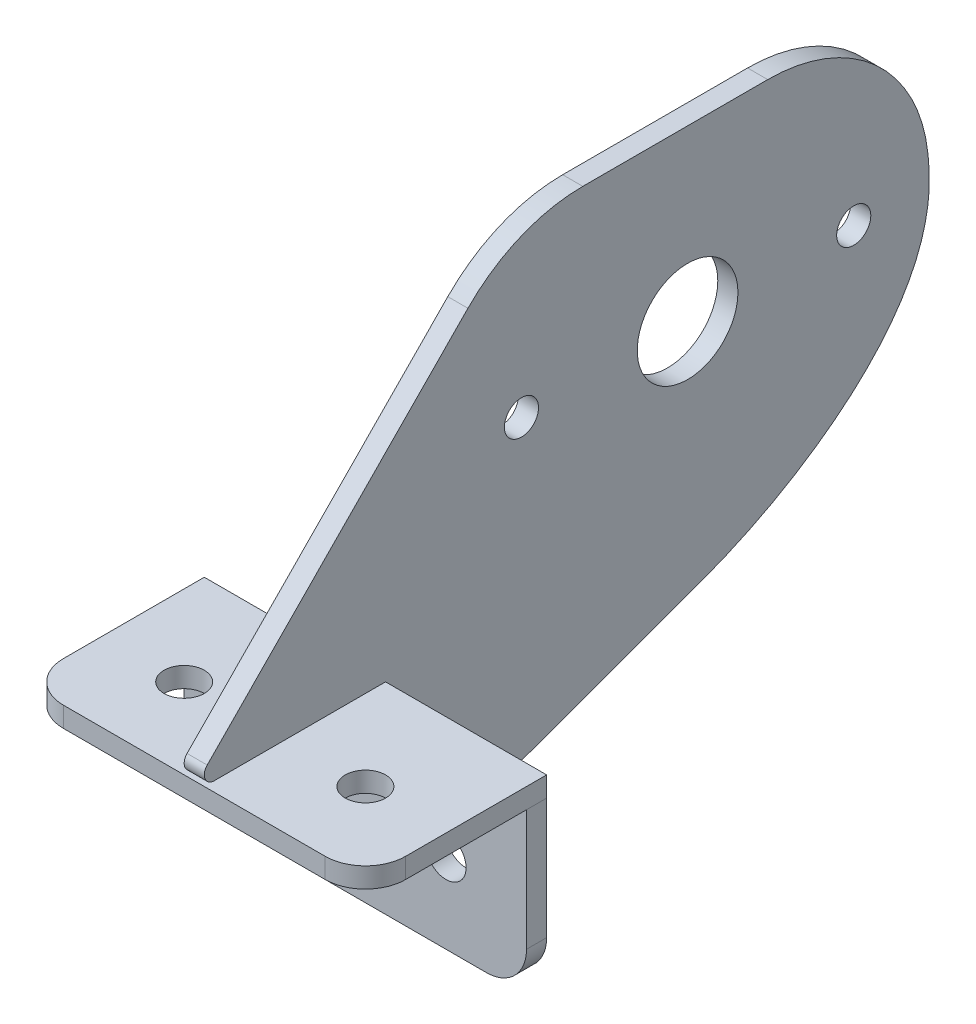
ISO-10303-21;
HEADER;
FILE_DESCRIPTION(('STEP AP214'),'2;1');
FILE_NAME('part.step','',(''),(''),'','','');
FILE_SCHEMA(('AUTOMOTIVE_DESIGN { 1 0 10303 214 1 1 1 1 }'));
ENDSEC;
DATA;
#1=APPLICATION_CONTEXT('core data for automotive mechanical design processes');
#2=APPLICATION_PROTOCOL_DEFINITION('international standard','automotive_design',2000,#1);
#3=PRODUCT_CONTEXT('',#1,'mechanical');
#4=PRODUCT('Part','Part','',(#3));
#5=PRODUCT_RELATED_PRODUCT_CATEGORY('part','',(#4));
#6=PRODUCT_DEFINITION_FORMATION('','',#4);
#7=PRODUCT_DEFINITION_CONTEXT('part definition',#1,'design');
#8=PRODUCT_DEFINITION('design','',#6,#7);
#9=PRODUCT_DEFINITION_SHAPE('','',#8);
#10=(LENGTH_UNIT() NAMED_UNIT(*) SI_UNIT(.MILLI.,.METRE.));
#11=(NAMED_UNIT(*) PLANE_ANGLE_UNIT() SI_UNIT($,.RADIAN.));
#12=(NAMED_UNIT(*) SI_UNIT($,.STERADIAN.) SOLID_ANGLE_UNIT());
#13=UNCERTAINTY_MEASURE_WITH_UNIT(LENGTH_MEASURE(1.E-05),#10,'distance_accuracy_value','');
#14=(GEOMETRIC_REPRESENTATION_CONTEXT(3) GLOBAL_UNCERTAINTY_ASSIGNED_CONTEXT((#13)) GLOBAL_UNIT_ASSIGNED_CONTEXT((#10,
#11,#12)) REPRESENTATION_CONTEXT('',''));
#15=CARTESIAN_POINT('',(0.,0.,0.));
#16=DIRECTION('',(0.,0.,1.));
#17=DIRECTION('',(1.,0.,0.));
#18=AXIS2_PLACEMENT_3D('',#15,#16,#17);
#19=CARTESIAN_POINT('',(-19.05,-47.6251280434519,50.7988006165077));
#20=DIRECTION('',(0.,0.,1.));
#21=DIRECTION('',(1.,0.,0.));
#22=AXIS2_PLACEMENT_3D('',#19,#20,#21);
#23=PLANE('',#22);
#24=CARTESIAN_POINT('',(-12.7,-41.2751280434519,50.7988006165077));
#25=DIRECTION('',(0.,0.,1.));
#26=DIRECTION('',(1.,0.,0.));
#27=AXIS2_PLACEMENT_3D('',#24,#25,#26);
#28=CIRCLE('',#27,3.175);
#29=CARTESIAN_POINT('',(-9.525,-41.2751280434519,50.7988006165077));
#30=VERTEX_POINT('',#29);
#31=EDGE_CURVE('E149',#30,#30,#28,.T.);
#32=ORIENTED_EDGE('',*,*,#31,.F.);
#33=EDGE_LOOP('',(#32));
#34=FACE_BOUND('',#33,.T.);
#35=DIRECTION('',(0.,-1.,0.));
#36=VECTOR('',#35,1.);
#37=CARTESIAN_POINT('',(-25.4,-28.5751280434519,50.7988006165077));
#38=LINE('',#37,#36);
#39=CARTESIAN_POINT('',(-25.4,-28.5751280434519,50.7988006165077));
#40=VERTEX_POINT('',#39);
#41=CARTESIAN_POINT('',(-25.4,-47.6251280434519,50.7988006165077));
#42=VERTEX_POINT('',#41);
#43=EDGE_CURVE('E161',#40,#42,#38,.T.);
#44=ORIENTED_EDGE('',*,*,#43,.T.);
#45=CARTESIAN_POINT('',(-19.05,-47.6251280434519,50.7988006165077));
#46=DIRECTION('',(0.,0.,1.));
#47=DIRECTION('',(1.,0.,0.));
#48=AXIS2_PLACEMENT_3D('',#45,#46,#47);
#49=CIRCLE('',#48,6.35);
#50=CARTESIAN_POINT('',(-19.05,-53.9751280434519,50.7988006165077));
#51=VERTEX_POINT('',#50);
#52=EDGE_CURVE('E112',#42,#51,#49,.T.);
#53=ORIENTED_EDGE('',*,*,#52,.T.);
#54=DIRECTION('',(1.,0.,0.));
#55=VECTOR('',#54,1.);
#56=CARTESIAN_POINT('',(-19.05,-53.9751280434519,50.7988006165077));
#57=LINE('',#56,#55);
#58=CARTESIAN_POINT('',(22.225,-53.9751280434519,50.7988006165077));
#59=VERTEX_POINT('',#58);
#60=EDGE_CURVE('E125',#51,#59,#57,.T.);
#61=ORIENTED_EDGE('',*,*,#60,.T.);
#62=CARTESIAN_POINT('',(22.225,-47.6251280434519,50.7988006165077));
#63=DIRECTION('',(0.,0.,1.));
#64=DIRECTION('',(1.,0.,0.));
#65=AXIS2_PLACEMENT_3D('',#62,#63,#64);
#66=CIRCLE('',#65,6.35);
#67=CARTESIAN_POINT('',(28.575,-47.6251280434519,50.7988006165077));
#68=VERTEX_POINT('',#67);
#69=EDGE_CURVE('E119',#59,#68,#66,.T.);
#70=ORIENTED_EDGE('',*,*,#69,.T.);
#71=DIRECTION('',(0.,1.,0.));
#72=VECTOR('',#71,1.);
#73=CARTESIAN_POINT('',(28.575,-28.5751280434519,50.7988006165077));
#74=LINE('',#73,#72);
#75=CARTESIAN_POINT('',(28.575,-28.5751280434519,50.7988006165077));
#76=VERTEX_POINT('',#75);
#77=EDGE_CURVE('E123',#68,#76,#74,.T.);
#78=ORIENTED_EDGE('',*,*,#77,.T.);
#79=DIRECTION('',(-1.,0.,0.));
#80=VECTOR('',#79,1.);
#81=CARTESIAN_POINT('',(-25.4,-28.5751280434519,50.7988006165077));
#82=LINE('',#81,#80);
#83=EDGE_CURVE('E75',#76,#40,#82,.T.);
#84=ORIENTED_EDGE('',*,*,#83,.T.);
#85=EDGE_LOOP('',(#44,#53,#61,#70,#78,#84));
#86=FACE_BOUND('',#85,.T.);
#87=CARTESIAN_POINT('',(15.875,-41.2751280434519,50.7988006165077));
#88=DIRECTION('',(0.,0.,1.));
#89=DIRECTION('',(1.,0.,0.));
#90=AXIS2_PLACEMENT_3D('',#87,#88,#89);
#91=CIRCLE('',#90,3.175);
#92=CARTESIAN_POINT('',(19.05,-41.2751280434519,50.7988006165077));
#93=VERTEX_POINT('',#92);
#94=EDGE_CURVE('E189',#93,#93,#91,.T.);
#95=ORIENTED_EDGE('',*,*,#94,.F.);
#96=EDGE_LOOP('',(#95));
#97=FACE_BOUND('',#96,.T.);
#98=ADVANCED_FACE('F58',(#34,#86,#97),#23,.T.);
#99=CARTESIAN_POINT('',(-19.05,-47.6251280434519,47.6238006165077));
#100=DIRECTION('',(0.,0.,1.));
#101=DIRECTION('',(1.,0.,0.));
#102=AXIS2_PLACEMENT_3D('',#99,#100,#101);
#103=PLANE('',#102);
#104=DIRECTION('',(0.,-1.,0.));
#105=VECTOR('',#104,1.);
#106=CARTESIAN_POINT('',(-25.4,-28.5751280434519,47.6238006165077));
#107=LINE('',#106,#105);
#108=CARTESIAN_POINT('',(-25.4,-28.5751280434519,47.6238006165077));
#109=VERTEX_POINT('',#108);
#110=CARTESIAN_POINT('',(-25.4,-47.6251280434519,47.6238006165077));
#111=VERTEX_POINT('',#110);
#112=EDGE_CURVE('E143',#109,#111,#107,.T.);
#113=ORIENTED_EDGE('',*,*,#112,.F.);
#114=DIRECTION('',(-1.,0.,0.));
#115=VECTOR('',#114,1.);
#116=CARTESIAN_POINT('',(-25.4,-28.5751280434519,47.6238006165077));
#117=LINE('',#116,#115);
#118=CARTESIAN_POINT('',(28.575,-28.5751280434519,47.6238006165077));
#119=VERTEX_POINT('',#118);
#120=EDGE_CURVE('E104',#119,#109,#117,.T.);
#121=ORIENTED_EDGE('',*,*,#120,.F.);
#122=DIRECTION('',(0.,1.,0.));
#123=VECTOR('',#122,1.);
#124=CARTESIAN_POINT('',(28.575,-28.5751280434519,47.6238006165077));
#125=LINE('',#124,#123);
#126=CARTESIAN_POINT('',(28.575,-47.6251280434519,47.6238006165077));
#127=VERTEX_POINT('',#126);
#128=EDGE_CURVE('E98',#127,#119,#125,.T.);
#129=ORIENTED_EDGE('',*,*,#128,.F.);
#130=CARTESIAN_POINT('',(22.225,-47.6251280434519,47.6238006165077));
#131=DIRECTION('',(0.,0.,1.));
#132=DIRECTION('',(1.,0.,0.));
#133=AXIS2_PLACEMENT_3D('',#130,#131,#132);
#134=CIRCLE('',#133,6.35);
#135=CARTESIAN_POINT('',(22.225,-53.9751280434519,47.6238006165077));
#136=VERTEX_POINT('',#135);
#137=EDGE_CURVE('E133',#136,#127,#134,.T.);
#138=ORIENTED_EDGE('',*,*,#137,.F.);
#139=DIRECTION('',(1.,0.,0.));
#140=VECTOR('',#139,1.);
#141=CARTESIAN_POINT('',(-19.05,-53.9751280434519,47.6238006165077));
#142=LINE('',#141,#140);
#143=CARTESIAN_POINT('',(-19.05,-53.9751280434519,47.6238006165077));
#144=VERTEX_POINT('',#143);
#145=EDGE_CURVE('E170',#144,#136,#142,.T.);
#146=ORIENTED_EDGE('',*,*,#145,.F.);
#147=CARTESIAN_POINT('',(-19.05,-47.6251280434519,47.6238006165077));
#148=DIRECTION('',(0.,0.,1.));
#149=DIRECTION('',(1.,0.,0.));
#150=AXIS2_PLACEMENT_3D('',#147,#148,#149);
#151=CIRCLE('',#150,6.35);
#152=EDGE_CURVE('E148',#111,#144,#151,.T.);
#153=ORIENTED_EDGE('',*,*,#152,.F.);
#154=EDGE_LOOP('',(#113,#121,#129,#138,#146,#153));
#155=FACE_BOUND('',#154,.T.);
#156=CARTESIAN_POINT('',(-12.7,-41.2751280434519,47.6238006165077));
#157=DIRECTION('',(0.,0.,1.));
#158=DIRECTION('',(1.,0.,0.));
#159=AXIS2_PLACEMENT_3D('',#156,#157,#158);
#160=CIRCLE('',#159,3.175);
#161=CARTESIAN_POINT('',(-9.525,-41.2751280434519,47.6238006165077));
#162=VERTEX_POINT('',#161);
#163=EDGE_CURVE('E183',#162,#162,#160,.T.);
#164=ORIENTED_EDGE('',*,*,#163,.T.);
#165=EDGE_LOOP('',(#164));
#166=FACE_BOUND('',#165,.T.);
#167=CARTESIAN_POINT('',(15.875,-41.2751280434519,47.6238006165077));
#168=DIRECTION('',(0.,0.,1.));
#169=DIRECTION('',(1.,0.,0.));
#170=AXIS2_PLACEMENT_3D('',#167,#168,#169);
#171=CIRCLE('',#170,3.175);
#172=CARTESIAN_POINT('',(19.05,-41.2751280434519,47.6238006165077));
#173=VERTEX_POINT('',#172);
#174=EDGE_CURVE('E285',#173,#173,#171,.T.);
#175=ORIENTED_EDGE('',*,*,#174,.T.);
#176=EDGE_LOOP('',(#175));
#177=FACE_BOUND('',#176,.T.);
#178=ADVANCED_FACE('F173',(#155,#166,#177),#103,.F.);
#179=CARTESIAN_POINT('',(-25.4,-28.5751280434519,50.7988006165077));
#180=DIRECTION('',(1.,0.,0.));
#181=DIRECTION('',(0.,1.,0.));
#182=AXIS2_PLACEMENT_3D('',#179,#180,#181);
#183=PLANE('',#182);
#184=ORIENTED_EDGE('',*,*,#112,.T.);
#185=DIRECTION('',(0.,0.,-1.));
#186=VECTOR('',#185,1.);
#187=CARTESIAN_POINT('',(-25.4,-47.6251280434519,50.7988006165077));
#188=LINE('',#187,#186);
#189=EDGE_CURVE('E13',#42,#111,#188,.T.);
#190=ORIENTED_EDGE('',*,*,#189,.F.);
#191=ORIENTED_EDGE('',*,*,#43,.F.);
#192=DIRECTION('',(0.,0.,-1.));
#193=VECTOR('',#192,1.);
#194=CARTESIAN_POINT('',(-25.4,-28.5751280434519,50.7988006165077));
#195=LINE('',#194,#193);
#196=EDGE_CURVE('E139',#40,#109,#195,.T.);
#197=ORIENTED_EDGE('',*,*,#196,.T.);
#198=EDGE_LOOP('',(#184,#190,#191,#197));
#199=FACE_BOUND('',#198,.T.);
#200=ADVANCED_FACE('F60',(#199),#183,.F.);
#201=CARTESIAN_POINT('',(-19.05,-47.6251280434519,50.7988006165077));
#202=DIRECTION('',(0.,0.,-1.));
#203=DIRECTION('',(-1.,0.,0.));
#204=AXIS2_PLACEMENT_3D('',#201,#202,#203);
#205=CYLINDRICAL_SURFACE('',#204,6.35);
#206=ORIENTED_EDGE('',*,*,#152,.T.);
#207=DIRECTION('',(0.,0.,-1.));
#208=VECTOR('',#207,1.);
#209=CARTESIAN_POINT('',(-19.05,-53.9751280434519,50.7988006165077));
#210=LINE('',#209,#208);
#211=EDGE_CURVE('E67',#51,#144,#210,.T.);
#212=ORIENTED_EDGE('',*,*,#211,.F.);
#213=ORIENTED_EDGE('',*,*,#52,.F.);
#214=ORIENTED_EDGE('',*,*,#189,.T.);
#215=EDGE_LOOP('',(#206,#212,#213,#214));
#216=FACE_BOUND('',#215,.T.);
#217=ADVANCED_FACE('F194',(#216),#205,.T.);
#218=CARTESIAN_POINT('',(-19.05,-53.9751280434519,50.7988006165077));
#219=DIRECTION('',(0.,1.,0.));
#220=DIRECTION('',(0.,0.,1.));
#221=AXIS2_PLACEMENT_3D('',#218,#219,#220);
#222=PLANE('',#221);
#223=ORIENTED_EDGE('',*,*,#145,.T.);
#224=DIRECTION('',(0.,0.,-1.));
#225=VECTOR('',#224,1.);
#226=CARTESIAN_POINT('',(22.225,-53.9751280434519,50.7988006165077));
#227=LINE('',#226,#225);
#228=EDGE_CURVE('E134',#59,#136,#227,.T.);
#229=ORIENTED_EDGE('',*,*,#228,.F.);
#230=ORIENTED_EDGE('',*,*,#60,.F.);
#231=ORIENTED_EDGE('',*,*,#211,.T.);
#232=EDGE_LOOP('',(#223,#229,#230,#231));
#233=FACE_BOUND('',#232,.T.);
#234=ADVANCED_FACE('F169',(#233),#222,.F.);
#235=CARTESIAN_POINT('',(22.225,-47.6251280434519,50.7988006165077));
#236=DIRECTION('',(0.,0.,-1.));
#237=DIRECTION('',(-1.,0.,0.));
#238=AXIS2_PLACEMENT_3D('',#235,#236,#237);
#239=CYLINDRICAL_SURFACE('',#238,6.35);
#240=ORIENTED_EDGE('',*,*,#137,.T.);
#241=DIRECTION('',(0.,0.,-1.));
#242=VECTOR('',#241,1.);
#243=CARTESIAN_POINT('',(28.575,-47.6251280434519,50.7988006165077));
#244=LINE('',#243,#242);
#245=EDGE_CURVE('E130',#68,#127,#244,.T.);
#246=ORIENTED_EDGE('',*,*,#245,.F.);
#247=ORIENTED_EDGE('',*,*,#69,.F.);
#248=ORIENTED_EDGE('',*,*,#228,.T.);
#249=EDGE_LOOP('',(#240,#246,#247,#248));
#250=FACE_BOUND('',#249,.T.);
#251=ADVANCED_FACE('F131',(#250),#239,.T.);
#252=CARTESIAN_POINT('',(28.575,-28.5751280434519,50.7988006165077));
#253=DIRECTION('',(-1.,0.,0.));
#254=DIRECTION('',(0.,0.,1.));
#255=AXIS2_PLACEMENT_3D('',#252,#253,#254);
#256=PLANE('',#255);
#257=ORIENTED_EDGE('',*,*,#128,.T.);
#258=DIRECTION('',(0.,0.,-1.));
#259=VECTOR('',#258,1.);
#260=CARTESIAN_POINT('',(28.575,-28.5751280434519,50.7988006165077));
#261=LINE('',#260,#259);
#262=EDGE_CURVE('E135',#76,#119,#261,.T.);
#263=ORIENTED_EDGE('',*,*,#262,.F.);
#264=ORIENTED_EDGE('',*,*,#77,.F.);
#265=ORIENTED_EDGE('',*,*,#245,.T.);
#266=EDGE_LOOP('',(#257,#263,#264,#265));
#267=FACE_BOUND('',#266,.T.);
#268=ADVANCED_FACE('F137',(#267),#256,.F.);
#269=CARTESIAN_POINT('',(-25.4,-28.5751280434519,50.7988006165077));
#270=DIRECTION('',(0.,-1.,0.));
#271=DIRECTION('',(0.,0.,-1.));
#272=AXIS2_PLACEMENT_3D('',#269,#270,#271);
#273=PLANE('',#272);
#274=ORIENTED_EDGE('',*,*,#120,.T.);
#275=ORIENTED_EDGE('',*,*,#196,.F.);
#276=ORIENTED_EDGE('',*,*,#83,.F.);
#277=ORIENTED_EDGE('',*,*,#262,.T.);
#278=EDGE_LOOP('',(#274,#275,#276,#277));
#279=FACE_BOUND('',#278,.T.);
#280=ADVANCED_FACE('F213',(#279),#273,.F.);
#281=CARTESIAN_POINT('',(-12.7,-41.2751280434519,50.7988006165077));
#282=DIRECTION('',(0.,0.,-1.));
#283=DIRECTION('',(-1.,0.,0.));
#284=AXIS2_PLACEMENT_3D('',#281,#282,#283);
#285=CYLINDRICAL_SURFACE('',#284,3.175);
#286=ORIENTED_EDGE('',*,*,#31,.T.);
#287=EDGE_LOOP('',(#286));
#288=FACE_BOUND('',#287,.T.);
#289=ORIENTED_EDGE('',*,*,#163,.F.);
#290=EDGE_LOOP('',(#289));
#291=FACE_BOUND('',#290,.T.);
#292=ADVANCED_FACE('F210',(#288,#291),#285,.F.);
#293=CARTESIAN_POINT('',(15.875,-41.2751280434519,50.7988006165077));
#294=DIRECTION('',(0.,0.,-1.));
#295=DIRECTION('',(-1.,0.,0.));
#296=AXIS2_PLACEMENT_3D('',#293,#294,#295);
#297=CYLINDRICAL_SURFACE('',#296,3.175);
#298=ORIENTED_EDGE('',*,*,#94,.T.);
#299=EDGE_LOOP('',(#298));
#300=FACE_BOUND('',#299,.T.);
#301=ORIENTED_EDGE('',*,*,#174,.F.);
#302=EDGE_LOOP('',(#301));
#303=FACE_BOUND('',#302,.T.);
#304=ADVANCED_FACE('F237',(#300,#303),#297,.F.);
#305=CLOSED_SHELL('',(#98,#178,#200,#217,#234,#251,#268,#280,#292,#304));
#306=MANIFOLD_SOLID_BREP('B2',#305);
#307=CARTESIAN_POINT('',(-19.05,-28.5751280434519,69.8488006165077));
#308=DIRECTION('',(0.,-1.,0.));
#309=DIRECTION('',(0.,0.,-1.));
#310=AXIS2_PLACEMENT_3D('',#307,#308,#309);
#311=PLANE('',#310);
#312=CARTESIAN_POINT('',(15.875,-28.5751280434519,63.4988006165077));
#313=DIRECTION('',(0.,-1.,0.));
#314=DIRECTION('',(0.,0.,-1.));
#315=AXIS2_PLACEMENT_3D('',#312,#313,#314);
#316=CIRCLE('',#315,3.17499999999999);
#317=CARTESIAN_POINT('',(15.875,-28.5751280434519,60.3238006165077));
#318=VERTEX_POINT('',#317);
#319=EDGE_CURVE('E400',#318,#318,#316,.T.);
#320=ORIENTED_EDGE('',*,*,#319,.F.);
#321=EDGE_LOOP('',(#320));
#322=FACE_BOUND('',#321,.T.);
#323=DIRECTION('',(1.,0.,0.));
#324=VECTOR('',#323,1.);
#325=CARTESIAN_POINT('',(28.575,-28.5751280434519,47.6238006165077));
#326=LINE('',#325,#324);
#327=CARTESIAN_POINT('',(-25.4,-28.5751280434519,47.6238006165077));
#328=VERTEX_POINT('',#327);
#329=CARTESIAN_POINT('',(28.575,-28.5751280434519,47.6238006165077));
#330=VERTEX_POINT('',#329);
#331=EDGE_CURVE('E412',#328,#330,#326,.T.);
#332=ORIENTED_EDGE('',*,*,#331,.T.);
#333=DIRECTION('',(0.,0.,1.));
#334=VECTOR('',#333,1.);
#335=CARTESIAN_POINT('',(28.575,-28.5751280434519,69.8488006165077));
#336=LINE('',#335,#334);
#337=CARTESIAN_POINT('',(28.575,-28.5751280434519,69.8488006165077));
#338=VERTEX_POINT('',#337);
#339=EDGE_CURVE('E363',#330,#338,#336,.T.);
#340=ORIENTED_EDGE('',*,*,#339,.T.);
#341=CARTESIAN_POINT('',(22.225,-28.5751280434519,69.8488006165077));
#342=DIRECTION('',(0.,-1.,0.));
#343=DIRECTION('',(0.,0.,-1.));
#344=AXIS2_PLACEMENT_3D('',#341,#342,#343);
#345=CIRCLE('',#344,6.35);
#346=CARTESIAN_POINT('',(22.225,-28.5751280434519,76.1988006165077));
#347=VERTEX_POINT('',#346);
#348=EDGE_CURVE('E376',#338,#347,#345,.T.);
#349=ORIENTED_EDGE('',*,*,#348,.T.);
#350=DIRECTION('',(-1.,0.,0.));
#351=VECTOR('',#350,1.);
#352=CARTESIAN_POINT('',(22.225,-28.5751280434519,76.1988006165077));
#353=LINE('',#352,#351);
#354=CARTESIAN_POINT('',(-19.05,-28.5751280434519,76.1988006165077));
#355=VERTEX_POINT('',#354);
#356=EDGE_CURVE('E370',#347,#355,#353,.T.);
#357=ORIENTED_EDGE('',*,*,#356,.T.);
#358=CARTESIAN_POINT('',(-19.05,-28.5751280434519,69.8488006165077));
#359=DIRECTION('',(0.,-1.,0.));
#360=DIRECTION('',(0.,0.,-1.));
#361=AXIS2_PLACEMENT_3D('',#358,#359,#360);
#362=CIRCLE('',#361,6.35);
#363=CARTESIAN_POINT('',(-25.4,-28.5751280434519,69.8488006165077));
#364=VERTEX_POINT('',#363);
#365=EDGE_CURVE('E374',#355,#364,#362,.T.);
#366=ORIENTED_EDGE('',*,*,#365,.T.);
#367=DIRECTION('',(0.,0.,-1.));
#368=VECTOR('',#367,1.);
#369=CARTESIAN_POINT('',(-25.4,-28.5751280434519,69.8488006165077));
#370=LINE('',#369,#368);
#371=EDGE_CURVE('E326',#364,#328,#370,.T.);
#372=ORIENTED_EDGE('',*,*,#371,.T.);
#373=EDGE_LOOP('',(#332,#340,#349,#357,#366,#372));
#374=FACE_BOUND('',#373,.T.);
#375=CARTESIAN_POINT('',(-12.7,-28.5751280434519,63.4988006165077));
#376=DIRECTION('',(0.,-1.,0.));
#377=DIRECTION('',(0.,0.,-1.));
#378=AXIS2_PLACEMENT_3D('',#375,#376,#377);
#379=CIRCLE('',#378,3.17499999999999);
#380=CARTESIAN_POINT('',(-12.7,-28.5751280434519,60.3238006165077));
#381=VERTEX_POINT('',#380);
#382=EDGE_CURVE('E440',#381,#381,#379,.T.);
#383=ORIENTED_EDGE('',*,*,#382,.F.);
#384=EDGE_LOOP('',(#383));
#385=FACE_BOUND('',#384,.T.);
#386=ADVANCED_FACE('F309',(#322,#374,#385),#311,.T.);
#387=CARTESIAN_POINT('',(-19.05,-25.4001280434519,69.8488006165077));
#388=DIRECTION('',(0.,-1.,0.));
#389=DIRECTION('',(0.,0.,-1.));
#390=AXIS2_PLACEMENT_3D('',#387,#388,#389);
#391=PLANE('',#390);
#392=DIRECTION('',(1.,0.,0.));
#393=VECTOR('',#392,1.);
#394=CARTESIAN_POINT('',(28.575,-25.4001280434519,47.6238006165077));
#395=LINE('',#394,#393);
#396=CARTESIAN_POINT('',(-25.4,-25.4001280434519,47.6238006165077));
#397=VERTEX_POINT('',#396);
#398=CARTESIAN_POINT('',(28.575,-25.4001280434519,47.6238006165077));
#399=VERTEX_POINT('',#398);
#400=EDGE_CURVE('E394',#397,#399,#395,.T.);
#401=ORIENTED_EDGE('',*,*,#400,.F.);
#402=DIRECTION('',(0.,0.,-1.));
#403=VECTOR('',#402,1.);
#404=CARTESIAN_POINT('',(-25.4,-25.4001280434519,69.8488006165077));
#405=LINE('',#404,#403);
#406=CARTESIAN_POINT('',(-25.4,-25.4001280434519,69.8488006165077));
#407=VERTEX_POINT('',#406);
#408=EDGE_CURVE('E355',#407,#397,#405,.T.);
#409=ORIENTED_EDGE('',*,*,#408,.F.);
#410=CARTESIAN_POINT('',(-19.05,-25.4001280434519,69.8488006165077));
#411=DIRECTION('',(0.,-1.,0.));
#412=DIRECTION('',(0.,0.,-1.));
#413=AXIS2_PLACEMENT_3D('',#410,#411,#412);
#414=CIRCLE('',#413,6.35);
#415=CARTESIAN_POINT('',(-19.05,-25.4001280434519,76.1988006165077));
#416=VERTEX_POINT('',#415);
#417=EDGE_CURVE('E349',#416,#407,#414,.T.);
#418=ORIENTED_EDGE('',*,*,#417,.F.);
#419=DIRECTION('',(-1.,0.,0.));
#420=VECTOR('',#419,1.);
#421=CARTESIAN_POINT('',(22.225,-25.4001280434519,76.1988006165077));
#422=LINE('',#421,#420);
#423=CARTESIAN_POINT('',(22.225,-25.4001280434519,76.1988006165077));
#424=VERTEX_POINT('',#423);
#425=EDGE_CURVE('E384',#424,#416,#422,.T.);
#426=ORIENTED_EDGE('',*,*,#425,.F.);
#427=CARTESIAN_POINT('',(22.225,-25.4001280434519,69.8488006165077));
#428=DIRECTION('',(0.,-1.,0.));
#429=DIRECTION('',(0.,0.,-1.));
#430=AXIS2_PLACEMENT_3D('',#427,#428,#429);
#431=CIRCLE('',#430,6.35);
#432=CARTESIAN_POINT('',(28.575,-25.4001280434519,69.8488006165077));
#433=VERTEX_POINT('',#432);
#434=EDGE_CURVE('E421',#433,#424,#431,.T.);
#435=ORIENTED_EDGE('',*,*,#434,.F.);
#436=DIRECTION('',(0.,0.,1.));
#437=VECTOR('',#436,1.);
#438=CARTESIAN_POINT('',(28.575,-25.4001280434519,69.8488006165077));
#439=LINE('',#438,#437);
#440=EDGE_CURVE('E399',#399,#433,#439,.T.);
#441=ORIENTED_EDGE('',*,*,#440,.F.);
#442=EDGE_LOOP('',(#401,#409,#418,#426,#435,#441));
#443=FACE_BOUND('',#442,.T.);
#444=CARTESIAN_POINT('',(15.875,-25.4001280434519,63.4988006165077));
#445=DIRECTION('',(0.,-1.,0.));
#446=DIRECTION('',(0.,0.,-1.));
#447=AXIS2_PLACEMENT_3D('',#444,#445,#446);
#448=CIRCLE('',#447,3.17499999999999);
#449=CARTESIAN_POINT('',(15.875,-25.4001280434519,60.3238006165077));
#450=VERTEX_POINT('',#449);
#451=EDGE_CURVE('E434',#450,#450,#448,.T.);
#452=ORIENTED_EDGE('',*,*,#451,.T.);
#453=EDGE_LOOP('',(#452));
#454=FACE_BOUND('',#453,.T.);
#455=CARTESIAN_POINT('',(-12.7,-25.4001280434519,63.4988006165077));
#456=DIRECTION('',(0.,-1.,0.));
#457=DIRECTION('',(0.,0.,-1.));
#458=AXIS2_PLACEMENT_3D('',#455,#456,#457);
#459=CIRCLE('',#458,3.17499999999999);
#460=CARTESIAN_POINT('',(-12.7,-25.4001280434519,60.3238006165077));
#461=VERTEX_POINT('',#460);
#462=EDGE_CURVE('E536',#461,#461,#459,.T.);
#463=ORIENTED_EDGE('',*,*,#462,.T.);
#464=EDGE_LOOP('',(#463));
#465=FACE_BOUND('',#464,.T.);
#466=ADVANCED_FACE('F424',(#443,#454,#465),#391,.F.);
#467=CARTESIAN_POINT('',(28.575,-28.5751280434519,47.6238006165077));
#468=DIRECTION('',(0.,0.,1.));
#469=DIRECTION('',(0.,-1.,0.));
#470=AXIS2_PLACEMENT_3D('',#467,#468,#469);
#471=PLANE('',#470);
#472=ORIENTED_EDGE('',*,*,#400,.T.);
#473=DIRECTION('',(0.,1.,0.));
#474=VECTOR('',#473,1.);
#475=CARTESIAN_POINT('',(28.575,-28.5751280434519,47.6238006165077));
#476=LINE('',#475,#474);
#477=EDGE_CURVE('E56',#330,#399,#476,.T.);
#478=ORIENTED_EDGE('',*,*,#477,.F.);
#479=ORIENTED_EDGE('',*,*,#331,.F.);
#480=DIRECTION('',(0.,1.,0.));
#481=VECTOR('',#480,1.);
#482=CARTESIAN_POINT('',(-25.4,-28.5751280434519,47.6238006165077));
#483=LINE('',#482,#481);
#484=EDGE_CURVE('E390',#328,#397,#483,.T.);
#485=ORIENTED_EDGE('',*,*,#484,.T.);
#486=EDGE_LOOP('',(#472,#478,#479,#485));
#487=FACE_BOUND('',#486,.T.);
#488=ADVANCED_FACE('F311',(#487),#471,.F.);
#489=CARTESIAN_POINT('',(28.575,-28.5751280434519,69.8488006165077));
#490=DIRECTION('',(-1.,0.,0.));
#491=DIRECTION('',(0.,0.,1.));
#492=AXIS2_PLACEMENT_3D('',#489,#490,#491);
#493=PLANE('',#492);
#494=ORIENTED_EDGE('',*,*,#440,.T.);
#495=DIRECTION('',(0.,1.,0.));
#496=VECTOR('',#495,1.);
#497=CARTESIAN_POINT('',(28.575,-28.5751280434519,69.8488006165077));
#498=LINE('',#497,#496);
#499=EDGE_CURVE('E318',#338,#433,#498,.T.);
#500=ORIENTED_EDGE('',*,*,#499,.F.);
#501=ORIENTED_EDGE('',*,*,#339,.F.);
#502=ORIENTED_EDGE('',*,*,#477,.T.);
#503=EDGE_LOOP('',(#494,#500,#501,#502));
#504=FACE_BOUND('',#503,.T.);
#505=ADVANCED_FACE('F445',(#504),#493,.F.);
#506=CARTESIAN_POINT('',(22.225,-28.5751280434519,69.8488006165077));
#507=DIRECTION('',(0.,1.,0.));
#508=DIRECTION('',(0.,0.,1.));
#509=AXIS2_PLACEMENT_3D('',#506,#507,#508);
#510=CYLINDRICAL_SURFACE('',#509,6.35);
#511=ORIENTED_EDGE('',*,*,#434,.T.);
#512=DIRECTION('',(0.,1.,0.));
#513=VECTOR('',#512,1.);
#514=CARTESIAN_POINT('',(22.225,-28.5751280434519,76.1988006165077));
#515=LINE('',#514,#513);
#516=EDGE_CURVE('E385',#347,#424,#515,.T.);
#517=ORIENTED_EDGE('',*,*,#516,.F.);
#518=ORIENTED_EDGE('',*,*,#348,.F.);
#519=ORIENTED_EDGE('',*,*,#499,.T.);
#520=EDGE_LOOP('',(#511,#517,#518,#519));
#521=FACE_BOUND('',#520,.T.);
#522=ADVANCED_FACE('F420',(#521),#510,.T.);
#523=CARTESIAN_POINT('',(22.225,-28.5751280434519,76.1988006165077));
#524=DIRECTION('',(0.,0.,-1.));
#525=DIRECTION('',(0.,1.,0.));
#526=AXIS2_PLACEMENT_3D('',#523,#524,#525);
#527=PLANE('',#526);
#528=ORIENTED_EDGE('',*,*,#425,.T.);
#529=DIRECTION('',(0.,1.,0.));
#530=VECTOR('',#529,1.);
#531=CARTESIAN_POINT('',(-19.05,-28.5751280434519,76.1988006165077));
#532=LINE('',#531,#530);
#533=EDGE_CURVE('E381',#355,#416,#532,.T.);
#534=ORIENTED_EDGE('',*,*,#533,.F.);
#535=ORIENTED_EDGE('',*,*,#356,.F.);
#536=ORIENTED_EDGE('',*,*,#516,.T.);
#537=EDGE_LOOP('',(#528,#534,#535,#536));
#538=FACE_BOUND('',#537,.T.);
#539=ADVANCED_FACE('F382',(#538),#527,.F.);
#540=CARTESIAN_POINT('',(-19.05,-28.5751280434519,69.8488006165077));
#541=DIRECTION('',(0.,1.,0.));
#542=DIRECTION('',(0.,0.,1.));
#543=AXIS2_PLACEMENT_3D('',#540,#541,#542);
#544=CYLINDRICAL_SURFACE('',#543,6.35);
#545=ORIENTED_EDGE('',*,*,#417,.T.);
#546=DIRECTION('',(0.,1.,0.));
#547=VECTOR('',#546,1.);
#548=CARTESIAN_POINT('',(-25.4,-28.5751280434519,69.8488006165077));
#549=LINE('',#548,#547);
#550=EDGE_CURVE('E386',#364,#407,#549,.T.);
#551=ORIENTED_EDGE('',*,*,#550,.F.);
#552=ORIENTED_EDGE('',*,*,#365,.F.);
#553=ORIENTED_EDGE('',*,*,#533,.T.);
#554=EDGE_LOOP('',(#545,#551,#552,#553));
#555=FACE_BOUND('',#554,.T.);
#556=ADVANCED_FACE('F388',(#555),#544,.T.);
#557=CARTESIAN_POINT('',(-25.4,-28.5751280434519,69.8488006165077));
#558=DIRECTION('',(1.,0.,0.));
#559=DIRECTION('',(0.,0.,-1.));
#560=AXIS2_PLACEMENT_3D('',#557,#558,#559);
#561=PLANE('',#560);
#562=ORIENTED_EDGE('',*,*,#408,.T.);
#563=ORIENTED_EDGE('',*,*,#484,.F.);
#564=ORIENTED_EDGE('',*,*,#371,.F.);
#565=ORIENTED_EDGE('',*,*,#550,.T.);
#566=EDGE_LOOP('',(#562,#563,#564,#565));
#567=FACE_BOUND('',#566,.T.);
#568=ADVANCED_FACE('F464',(#567),#561,.F.);
#569=CARTESIAN_POINT('',(15.875,-28.5751280434519,63.4988006165077));
#570=DIRECTION('',(0.,1.,0.));
#571=DIRECTION('',(0.,0.,1.));
#572=AXIS2_PLACEMENT_3D('',#569,#570,#571);
#573=CYLINDRICAL_SURFACE('',#572,3.17499999999999);
#574=ORIENTED_EDGE('',*,*,#319,.T.);
#575=EDGE_LOOP('',(#574));
#576=FACE_BOUND('',#575,.T.);
#577=ORIENTED_EDGE('',*,*,#451,.F.);
#578=EDGE_LOOP('',(#577));
#579=FACE_BOUND('',#578,.T.);
#580=ADVANCED_FACE('F461',(#576,#579),#573,.F.);
#581=CARTESIAN_POINT('',(-12.7,-28.5751280434519,63.4988006165077));
#582=DIRECTION('',(0.,1.,0.));
#583=DIRECTION('',(0.,0.,1.));
#584=AXIS2_PLACEMENT_3D('',#581,#582,#583);
#585=CYLINDRICAL_SURFACE('',#584,3.17499999999999);
#586=ORIENTED_EDGE('',*,*,#382,.T.);
#587=EDGE_LOOP('',(#586));
#588=FACE_BOUND('',#587,.T.);
#589=ORIENTED_EDGE('',*,*,#462,.F.);
#590=EDGE_LOOP('',(#589));
#591=FACE_BOUND('',#590,.T.);
#592=ADVANCED_FACE('F488',(#588,#591),#585,.F.);
#593=CLOSED_SHELL('',(#386,#466,#488,#505,#522,#539,#556,#568,#580,#592));
#594=MANIFOLD_SOLID_BREP('B7',#593);
#595=CARTESIAN_POINT('',(3.175,0.,0.));
#596=DIRECTION('',(-1.,0.,0.));
#597=DIRECTION('',(0.,0.,1.));
#598=AXIS2_PLACEMENT_3D('',#595,#596,#597);
#599=PLANE('',#598);
#600=CARTESIAN_POINT('',(3.175,0.,-26.19375));
#601=DIRECTION('',(1.,0.,0.));
#602=DIRECTION('',(0.,0.,-1.));
#603=AXIS2_PLACEMENT_3D('',#600,#601,#602);
#604=CIRCLE('',#603,2.6924);
#605=CARTESIAN_POINT('',(3.175,0.,-28.88615));
#606=VERTEX_POINT('',#605);
#607=EDGE_CURVE('E719',#606,#606,#604,.T.);
#608=ORIENTED_EDGE('',*,*,#607,.F.);
#609=EDGE_LOOP('',(#608));
#610=FACE_BOUND('',#609,.T.);
#611=CARTESIAN_POINT('',(3.175,0.,26.19375));
#612=DIRECTION('',(1.,0.,0.));
#613=DIRECTION('',(0.,0.,-1.));
#614=AXIS2_PLACEMENT_3D('',#611,#612,#613);
#615=CIRCLE('',#614,2.6924);
#616=CARTESIAN_POINT('',(3.175,0.,23.50135));
#617=VERTEX_POINT('',#616);
#618=EDGE_CURVE('E705',#617,#617,#615,.T.);
#619=ORIENTED_EDGE('',*,*,#618,.F.);
#620=EDGE_LOOP('',(#619));
#621=FACE_BOUND('',#620,.T.);
#622=DIRECTION('',(0.,0.,-1.));
#623=VECTOR('',#622,1.);
#624=CARTESIAN_POINT('',(3.175,26.7099579300931,-27.1696180939788));
#625=LINE('',#624,#623);
#626=CARTESIAN_POINT('',(3.175,26.7099579300931,16.521434980954));
#627=VERTEX_POINT('',#626);
#628=CARTESIAN_POINT('',(3.175,26.7099579300931,-12.6322606932167));
#629=VERTEX_POINT('',#628);
#630=EDGE_CURVE('E716',#627,#629,#625,.T.);
#631=ORIENTED_EDGE('',*,*,#630,.F.);
#632=CARTESIAN_POINT('',(3.175,1.3099579300931,16.521434980954));
#633=DIRECTION('',(-1.,0.,0.));
#634=DIRECTION('',(0.,0.,1.));
#635=AXIS2_PLACEMENT_3D('',#632,#633,#634);
#636=CIRCLE('',#635,25.4);
#637=CARTESIAN_POINT('',(3.175,19.1165965501552,34.6345137102732));
#638=VERTEX_POINT('',#637);
#639=EDGE_CURVE('E558',#627,#638,#636,.F.);
#640=ORIENTED_EDGE('',*,*,#639,.T.);
#641=DIRECTION('',(0.,-0.713113335799967,0.701048764569372));
#642=VECTOR('',#641,1.);
#643=CARTESIAN_POINT('',(3.175,26.7099579300931,27.1696180939788));
#644=LINE('',#643,#642);
#645=CARTESIAN_POINT('',(3.175,-22.699713129698,75.7433680370902));
#646=VERTEX_POINT('',#645);
#647=EDGE_CURVE('E631',#638,#646,#644,.T.);
#648=ORIENTED_EDGE('',*,*,#647,.T.);
#649=CARTESIAN_POINT('',(3.175,-23.8126280434519,74.6113006165077));
#650=DIRECTION('',(1.,0.,0.));
#651=DIRECTION('',(0.,0.,-1.));
#652=AXIS2_PLACEMENT_3D('',#649,#650,#651);
#653=CIRCLE('',#652,1.5875);
#654=CARTESIAN_POINT('',(3.175,-25.4001280434519,74.6113006165077));
#655=VERTEX_POINT('',#654);
#656=EDGE_CURVE('E635',#646,#655,#653,.T.);
#657=ORIENTED_EDGE('',*,*,#656,.T.);
#658=DIRECTION('',(0.,0.,-1.));
#659=VECTOR('',#658,1.);
#660=CARTESIAN_POINT('',(3.175,-25.4001280434519,74.6113006165077));
#661=LINE('',#660,#659);
#662=CARTESIAN_POINT('',(3.175,-25.4001280434519,47.6238006165077));
#663=VERTEX_POINT('',#662);
#664=EDGE_CURVE('E658',#655,#663,#661,.T.);
#665=ORIENTED_EDGE('',*,*,#664,.T.);
#666=DIRECTION('',(0.,-1.,0.));
#667=VECTOR('',#666,1.);
#668=CARTESIAN_POINT('',(3.175,-25.4001280434519,47.6238006165077));
#669=LINE('',#668,#667);
#670=CARTESIAN_POINT('',(3.175,-52.3876280434519,47.6238006165077));
#671=VERTEX_POINT('',#670);
#672=EDGE_CURVE('E661',#663,#671,#669,.T.);
#673=ORIENTED_EDGE('',*,*,#672,.T.);
#674=CARTESIAN_POINT('',(3.175,-52.3876280434519,46.0363006165077));
#675=DIRECTION('',(1.,0.,0.));
#676=DIRECTION('',(0.,0.,-1.));
#677=AXIS2_PLACEMENT_3D('',#674,#675,#676);
#678=CIRCLE('',#677,1.5875);
#679=CARTESIAN_POINT('',(3.175,-53.8793900789495,45.4933436389782));
#680=VERTEX_POINT('',#679);
#681=EDGE_CURVE('E678',#671,#680,#678,.T.);
#682=ORIENTED_EDGE('',*,*,#681,.T.);
#683=DIRECTION('',(0.,0.342020143325673,-0.939692620785907));
#684=VECTOR('',#683,1.);
#685=CARTESIAN_POINT('',(3.175,-53.8793900789495,45.4933436389782));
#686=LINE('',#685,#684);
#687=CARTESIAN_POINT('',(3.175,-36.5047667980053,-2.24304149694585));
#688=VERTEX_POINT('',#687);
#689=EDGE_CURVE('E682',#680,#688,#686,.T.);
#690=ORIENTED_EDGE('',*,*,#689,.T.);
#691=CARTESIAN_POINT('',(3.175,-36.5047667980054,-2.24304149694584));
#692=CARTESIAN_POINT('',(3.175,-31.4501822219903,-16.1303984842706));
#693=CARTESIAN_POINT('',(3.175,-18.3509944175199,-38.2579434080344));
#694=CARTESIAN_POINT('',(3.175,0.325028818924735,-38.0986135740773));
#695=B_SPLINE_CURVE_WITH_KNOTS('',3,(#691,#692,#693,#694),.UNSPECIFIED.,.F.,.F.,(4,4),(0.,1.),.UNSPECIFIED.);
#696=CARTESIAN_POINT('',(3.175,0.325028818924735,-38.0986135740773));
#697=VERTEX_POINT('',#696);
#698=EDGE_CURVE('E686',#688,#697,#695,.T.);
#699=ORIENTED_EDGE('',*,*,#698,.T.);
#700=CARTESIAN_POINT('',(3.175,0.,0.));
#701=DIRECTION('',(1.,0.,0.));
#702=DIRECTION('',(0.,0.,1.));
#703=AXIS2_PLACEMENT_3D('',#700,#701,#702);
#704=CIRCLE('',#703,38.1);
#705=CARTESIAN_POINT('',(3.175,3.9298737902793,-37.8967820796499));
#706=VERTEX_POINT('',#705);
#707=EDGE_CURVE('E642',#697,#706,#704,.T.);
#708=ORIENTED_EDGE('',*,*,#707,.T.);
#709=CARTESIAN_POINT('',(3.175,1.3099579300931,-12.6322606932167));
#710=DIRECTION('',(-1.,0.,0.));
#711=DIRECTION('',(0.,0.,1.));
#712=AXIS2_PLACEMENT_3D('',#709,#710,#711);
#713=CIRCLE('',#712,25.4);
#714=EDGE_CURVE('E565',#706,#629,#713,.F.);
#715=ORIENTED_EDGE('',*,*,#714,.T.);
#716=EDGE_LOOP('',(#631,#640,#648,#657,#665,#673,#682,#690,#699,#708,#715));
#717=FACE_BOUND('',#716,.T.);
#718=CARTESIAN_POINT('',(3.175,0.,0.));
#719=DIRECTION('',(1.,0.,0.));
#720=DIRECTION('',(0.,0.,-1.));
#721=AXIS2_PLACEMENT_3D('',#718,#719,#720);
#722=CIRCLE('',#721,7.9375);
#723=CARTESIAN_POINT('',(3.175,0.,-7.9375));
#724=VERTEX_POINT('',#723);
#725=EDGE_CURVE('E698',#724,#724,#722,.T.);
#726=ORIENTED_EDGE('',*,*,#725,.F.);
#727=EDGE_LOOP('',(#726));
#728=FACE_BOUND('',#727,.T.);
#729=ADVANCED_FACE('F550',(#610,#621,#717,#728),#599,.F.);
#730=CARTESIAN_POINT('',(0.,0.,0.));
#731=DIRECTION('',(-1.,0.,0.));
#732=DIRECTION('',(0.,0.,1.));
#733=AXIS2_PLACEMENT_3D('',#730,#731,#732);
#734=PLANE('',#733);
#735=CARTESIAN_POINT('',(0.,0.,-26.19375));
#736=DIRECTION('',(-1.,0.,0.));
#737=DIRECTION('',(0.,0.,1.));
#738=AXIS2_PLACEMENT_3D('',#735,#736,#737);
#739=CIRCLE('',#738,2.6924);
#740=CARTESIAN_POINT('',(0.,0.,-23.50135));
#741=VERTEX_POINT('',#740);
#742=EDGE_CURVE('E710',#741,#741,#739,.T.);
#743=ORIENTED_EDGE('',*,*,#742,.F.);
#744=EDGE_LOOP('',(#743));
#745=FACE_BOUND('',#744,.T.);
#746=DIRECTION('',(0.,-0.713113335799967,0.701048764569372));
#747=VECTOR('',#746,1.);
#748=CARTESIAN_POINT('',(0.,26.7099579300931,27.1696180939788));
#749=LINE('',#748,#747);
#750=CARTESIAN_POINT('',(0.,19.1165965501552,34.6345137102732));
#751=VERTEX_POINT('',#750);
#752=CARTESIAN_POINT('',(0.,-22.699713129698,75.7433680370902));
#753=VERTEX_POINT('',#752);
#754=EDGE_CURVE('E648',#751,#753,#749,.T.);
#755=ORIENTED_EDGE('',*,*,#754,.F.);
#756=CARTESIAN_POINT('',(0.,1.3099579300931,16.521434980954));
#757=DIRECTION('',(-1.,0.,0.));
#758=DIRECTION('',(0.,0.,1.));
#759=AXIS2_PLACEMENT_3D('',#756,#757,#758);
#760=CIRCLE('',#759,25.4);
#761=CARTESIAN_POINT('',(0.,26.7099579300931,16.521434980954));
#762=VERTEX_POINT('',#761);
#763=EDGE_CURVE('E738',#751,#762,#760,.T.);
#764=ORIENTED_EDGE('',*,*,#763,.T.);
#765=DIRECTION('',(0.,0.,1.));
#766=VECTOR('',#765,1.);
#767=CARTESIAN_POINT('',(0.,26.7099579300931,0.));
#768=LINE('',#767,#766);
#769=CARTESIAN_POINT('',(0.,26.7099579300931,-12.6322606932167));
#770=VERTEX_POINT('',#769);
#771=EDGE_CURVE('E711',#770,#762,#768,.T.);
#772=ORIENTED_EDGE('',*,*,#771,.F.);
#773=CARTESIAN_POINT('',(0.,1.3099579300931,-12.6322606932167));
#774=DIRECTION('',(-1.,0.,0.));
#775=DIRECTION('',(0.,0.,1.));
#776=AXIS2_PLACEMENT_3D('',#773,#774,#775);
#777=CIRCLE('',#776,25.4);
#778=CARTESIAN_POINT('',(0.,3.9298737902793,-37.8967820796499));
#779=VERTEX_POINT('',#778);
#780=EDGE_CURVE('E736',#770,#779,#777,.T.);
#781=ORIENTED_EDGE('',*,*,#780,.T.);
#782=CARTESIAN_POINT('',(0.,0.,0.));
#783=DIRECTION('',(1.,0.,0.));
#784=DIRECTION('',(0.,0.,1.));
#785=AXIS2_PLACEMENT_3D('',#782,#783,#784);
#786=CIRCLE('',#785,38.1);
#787=CARTESIAN_POINT('',(0.,0.325028818924735,-38.0986135740773));
#788=VERTEX_POINT('',#787);
#789=EDGE_CURVE('E704',#788,#779,#786,.T.);
#790=ORIENTED_EDGE('',*,*,#789,.F.);
#791=CARTESIAN_POINT('',(0.,-36.5047667980054,-2.24304149694584));
#792=CARTESIAN_POINT('',(0.,-31.4501822219903,-16.1303984842706));
#793=CARTESIAN_POINT('',(0.,-18.3509944175199,-38.2579434080344));
#794=CARTESIAN_POINT('',(0.,0.325028818924735,-38.0986135740773));
#795=B_SPLINE_CURVE_WITH_KNOTS('',3,(#791,#792,#793,#794),.UNSPECIFIED.,.F.,.F.,(4,4),(0.,1.),.UNSPECIFIED.);
#796=CARTESIAN_POINT('',(0.,-36.5047667980053,-2.24304149694585));
#797=VERTEX_POINT('',#796);
#798=EDGE_CURVE('E695',#797,#788,#795,.T.);
#799=ORIENTED_EDGE('',*,*,#798,.F.);
#800=DIRECTION('',(0.,0.342020143325673,-0.939692620785907));
#801=VECTOR('',#800,1.);
#802=CARTESIAN_POINT('',(0.,-53.8793900789495,45.4933436389782));
#803=LINE('',#802,#801);
#804=CARTESIAN_POINT('',(0.,-53.8793900789495,45.4933436389782));
#805=VERTEX_POINT('',#804);
#806=EDGE_CURVE('E791',#805,#797,#803,.T.);
#807=ORIENTED_EDGE('',*,*,#806,.F.);
#808=CARTESIAN_POINT('',(0.,-52.3876280434519,46.0363006165077));
#809=DIRECTION('',(1.,0.,0.));
#810=DIRECTION('',(0.,0.,-1.));
#811=AXIS2_PLACEMENT_3D('',#808,#809,#810);
#812=CIRCLE('',#811,1.5875);
#813=CARTESIAN_POINT('',(0.,-52.3876280434519,47.6238006165077));
#814=VERTEX_POINT('',#813);
#815=EDGE_CURVE('E786',#814,#805,#812,.T.);
#816=ORIENTED_EDGE('',*,*,#815,.F.);
#817=DIRECTION('',(0.,-1.,0.));
#818=VECTOR('',#817,1.);
#819=CARTESIAN_POINT('',(0.,-25.4001280434519,47.6238006165077));
#820=LINE('',#819,#818);
#821=CARTESIAN_POINT('',(0.,-25.4001280434519,47.6238006165077));
#822=VERTEX_POINT('',#821);
#823=EDGE_CURVE('E784',#822,#814,#820,.T.);
#824=ORIENTED_EDGE('',*,*,#823,.F.);
#825=DIRECTION('',(0.,0.,-1.));
#826=VECTOR('',#825,1.);
#827=CARTESIAN_POINT('',(0.,-25.4001280434519,74.6113006165077));
#828=LINE('',#827,#826);
#829=CARTESIAN_POINT('',(0.,-25.4001280434519,74.6113006165077));
#830=VERTEX_POINT('',#829);
#831=EDGE_CURVE('E777',#830,#822,#828,.T.);
#832=ORIENTED_EDGE('',*,*,#831,.F.);
#833=CARTESIAN_POINT('',(0.,-23.8126280434519,74.6113006165077));
#834=DIRECTION('',(1.,0.,0.));
#835=DIRECTION('',(0.,0.,-1.));
#836=AXIS2_PLACEMENT_3D('',#833,#834,#835);
#837=CIRCLE('',#836,1.5875);
#838=EDGE_CURVE('E782',#753,#830,#837,.T.);
#839=ORIENTED_EDGE('',*,*,#838,.F.);
#840=EDGE_LOOP('',(#755,#764,#772,#781,#790,#799,#807,#816,#824,#832,#839));
#841=FACE_BOUND('',#840,.T.);
#842=CARTESIAN_POINT('',(0.,0.,26.19375));
#843=DIRECTION('',(-1.,0.,0.));
#844=DIRECTION('',(0.,0.,1.));
#845=AXIS2_PLACEMENT_3D('',#842,#843,#844);
#846=CIRCLE('',#845,2.6924);
#847=CARTESIAN_POINT('',(0.,0.,28.88615));
#848=VERTEX_POINT('',#847);
#849=EDGE_CURVE('E699',#848,#848,#846,.T.);
#850=ORIENTED_EDGE('',*,*,#849,.F.);
#851=EDGE_LOOP('',(#850));
#852=FACE_BOUND('',#851,.T.);
#853=CARTESIAN_POINT('',(0.,0.,0.));
#854=DIRECTION('',(1.,0.,0.));
#855=DIRECTION('',(0.,0.,-1.));
#856=AXIS2_PLACEMENT_3D('',#853,#854,#855);
#857=CIRCLE('',#856,7.9375);
#858=CARTESIAN_POINT('',(0.,0.,-7.9375));
#859=VERTEX_POINT('',#858);
#860=EDGE_CURVE('E696',#859,#859,#857,.T.);
#861=ORIENTED_EDGE('',*,*,#860,.T.);
#862=EDGE_LOOP('',(#861));
#863=FACE_BOUND('',#862,.T.);
#864=ADVANCED_FACE('F780',(#745,#841,#852,#863),#734,.T.);
#865=CARTESIAN_POINT('',(3.175,0.,0.));
#866=DIRECTION('',(-1.,0.,0.));
#867=DIRECTION('',(0.,0.,1.));
#868=AXIS2_PLACEMENT_3D('',#865,#866,#867);
#869=CYLINDRICAL_SURFACE('',#868,38.1);
#870=ORIENTED_EDGE('',*,*,#789,.T.);
#871=DIRECTION('',(-1.,0.,0.));
#872=VECTOR('',#871,1.);
#873=CARTESIAN_POINT('',(3.175,3.9298737902793,-37.8967820796499));
#874=LINE('',#873,#872);
#875=EDGE_CURVE('E307',#779,#706,#874,.F.);
#876=ORIENTED_EDGE('',*,*,#875,.T.);
#877=ORIENTED_EDGE('',*,*,#707,.F.);
#878=DIRECTION('',(-1.,0.,0.));
#879=VECTOR('',#878,1.);
#880=CARTESIAN_POINT('',(3.175,0.325028818924735,-38.0986135740773));
#881=LINE('',#880,#879);
#882=EDGE_CURVE('E747',#697,#788,#881,.T.);
#883=ORIENTED_EDGE('',*,*,#882,.T.);
#884=EDGE_LOOP('',(#870,#876,#877,#883));
#885=FACE_BOUND('',#884,.T.);
#886=ADVANCED_FACE('F799',(#885),#869,.T.);
#887=CARTESIAN_POINT('',(3.175,26.7099579300931,27.1696180939788));
#888=DIRECTION('',(0.,-0.701048764569372,-0.713113335799967));
#889=DIRECTION('',(0.,0.713113335799967,-0.701048764569372));
#890=AXIS2_PLACEMENT_3D('',#887,#888,#889);
#891=PLANE('',#890);
#892=ORIENTED_EDGE('',*,*,#647,.F.);
#893=DIRECTION('',(-1.,0.,0.));
#894=VECTOR('',#893,1.);
#895=CARTESIAN_POINT('',(3.175,19.1165965501552,34.6345137102732));
#896=LINE('',#895,#894);
#897=EDGE_CURVE('E651',#638,#751,#896,.T.);
#898=ORIENTED_EDGE('',*,*,#897,.T.);
#899=ORIENTED_EDGE('',*,*,#754,.T.);
#900=DIRECTION('',(-1.,0.,0.));
#901=VECTOR('',#900,1.);
#902=CARTESIAN_POINT('',(3.175,-22.699713129698,75.7433680370902));
#903=LINE('',#902,#901);
#904=EDGE_CURVE('E645',#646,#753,#903,.T.);
#905=ORIENTED_EDGE('',*,*,#904,.F.);
#906=EDGE_LOOP('',(#892,#898,#899,#905));
#907=FACE_BOUND('',#906,.T.);
#908=ADVANCED_FACE('F646',(#907),#891,.F.);
#909=CARTESIAN_POINT('',(3.175,-23.8126280434519,74.6113006165077));
#910=DIRECTION('',(-1.,0.,0.));
#911=DIRECTION('',(0.,0.,1.));
#912=AXIS2_PLACEMENT_3D('',#909,#910,#911);
#913=CYLINDRICAL_SURFACE('',#912,1.5875);
#914=ORIENTED_EDGE('',*,*,#838,.T.);
#915=DIRECTION('',(-1.,0.,0.));
#916=VECTOR('',#915,1.);
#917=CARTESIAN_POINT('',(3.175,-25.4001280434519,74.6113006165077));
#918=LINE('',#917,#916);
#919=EDGE_CURVE('E652',#655,#830,#918,.T.);
#920=ORIENTED_EDGE('',*,*,#919,.F.);
#921=ORIENTED_EDGE('',*,*,#656,.F.);
#922=ORIENTED_EDGE('',*,*,#904,.T.);
#923=EDGE_LOOP('',(#914,#920,#921,#922));
#924=FACE_BOUND('',#923,.T.);
#925=ADVANCED_FACE('F654',(#924),#913,.T.);
#926=CARTESIAN_POINT('',(3.175,-25.4001280434519,74.6113006165077));
#927=DIRECTION('',(0.,1.,0.));
#928=DIRECTION('',(0.,0.,1.));
#929=AXIS2_PLACEMENT_3D('',#926,#927,#928);
#930=PLANE('',#929);
#931=ORIENTED_EDGE('',*,*,#831,.T.);
#932=DIRECTION('',(-1.,0.,0.));
#933=VECTOR('',#932,1.);
#934=CARTESIAN_POINT('',(3.175,-25.4001280434519,47.6238006165077));
#935=LINE('',#934,#933);
#936=EDGE_CURVE('E770',#663,#822,#935,.T.);
#937=ORIENTED_EDGE('',*,*,#936,.F.);
#938=ORIENTED_EDGE('',*,*,#664,.F.);
#939=ORIENTED_EDGE('',*,*,#919,.T.);
#940=EDGE_LOOP('',(#931,#937,#938,#939));
#941=FACE_BOUND('',#940,.T.);
#942=ADVANCED_FACE('F775',(#941),#930,.F.);
#943=CARTESIAN_POINT('',(3.175,-25.4001280434519,47.6238006165077));
#944=DIRECTION('',(0.,0.,-1.));
#945=DIRECTION('',(-1.,0.,0.));
#946=AXIS2_PLACEMENT_3D('',#943,#944,#945);
#947=PLANE('',#946);
#948=ORIENTED_EDGE('',*,*,#823,.T.);
#949=DIRECTION('',(-1.,0.,0.));
#950=VECTOR('',#949,1.);
#951=CARTESIAN_POINT('',(3.175,-52.3876280434519,47.6238006165077));
#952=LINE('',#951,#950);
#953=EDGE_CURVE('E767',#671,#814,#952,.T.);
#954=ORIENTED_EDGE('',*,*,#953,.F.);
#955=ORIENTED_EDGE('',*,*,#672,.F.);
#956=ORIENTED_EDGE('',*,*,#936,.T.);
#957=EDGE_LOOP('',(#948,#954,#955,#956));
#958=FACE_BOUND('',#957,.T.);
#959=ADVANCED_FACE('F832',(#958),#947,.F.);
#960=CARTESIAN_POINT('',(3.175,-52.3876280434519,46.0363006165077));
#961=DIRECTION('',(-1.,0.,0.));
#962=DIRECTION('',(0.,0.,1.));
#963=AXIS2_PLACEMENT_3D('',#960,#961,#962);
#964=CYLINDRICAL_SURFACE('',#963,1.5875);
#965=ORIENTED_EDGE('',*,*,#815,.T.);
#966=DIRECTION('',(-1.,0.,0.));
#967=VECTOR('',#966,1.);
#968=CARTESIAN_POINT('',(3.175,-53.8793900789495,45.4933436389782));
#969=LINE('',#968,#967);
#970=EDGE_CURVE('E758',#680,#805,#969,.T.);
#971=ORIENTED_EDGE('',*,*,#970,.F.);
#972=ORIENTED_EDGE('',*,*,#681,.F.);
#973=ORIENTED_EDGE('',*,*,#953,.T.);
#974=EDGE_LOOP('',(#965,#971,#972,#973));
#975=FACE_BOUND('',#974,.T.);
#976=ADVANCED_FACE('F829',(#975),#964,.T.);
#977=CARTESIAN_POINT('',(3.175,-53.8793900789495,45.4933436389782));
#978=DIRECTION('',(0.,0.939692620785907,0.342020143325673));
#979=DIRECTION('',(0.,-0.342020143325673,0.939692620785907));
#980=AXIS2_PLACEMENT_3D('',#977,#978,#979);
#981=PLANE('',#980);
#982=ORIENTED_EDGE('',*,*,#806,.T.);
#983=DIRECTION('',(-1.,0.,0.));
#984=VECTOR('',#983,1.);
#985=CARTESIAN_POINT('',(3.175,-36.5047667980053,-2.24304149694585));
#986=LINE('',#985,#984);
#987=EDGE_CURVE('E751',#688,#797,#986,.T.);
#988=ORIENTED_EDGE('',*,*,#987,.F.);
#989=ORIENTED_EDGE('',*,*,#689,.F.);
#990=ORIENTED_EDGE('',*,*,#970,.T.);
#991=EDGE_LOOP('',(#982,#988,#989,#990));
#992=FACE_BOUND('',#991,.T.);
#993=ADVANCED_FACE('F826',(#992),#981,.F.);
#994=DIRECTION('',(-1.,0.,0.));
#995=VECTOR('',#994,1.);
#996=SURFACE_OF_LINEAR_EXTRUSION('',#695,#995);
#997=ORIENTED_EDGE('',*,*,#798,.T.);
#998=ORIENTED_EDGE('',*,*,#882,.F.);
#999=ORIENTED_EDGE('',*,*,#698,.F.);
#1000=ORIENTED_EDGE('',*,*,#987,.T.);
#1001=EDGE_LOOP('',(#997,#998,#999,#1000));
#1002=FACE_BOUND('',#1001,.T.);
#1003=ADVANCED_FACE('F797',(#1002),#996,.F.);
#1004=CARTESIAN_POINT('',(3.175,0.,0.));
#1005=DIRECTION('',(-1.,0.,0.));
#1006=DIRECTION('',(0.,0.,1.));
#1007=AXIS2_PLACEMENT_3D('',#1004,#1005,#1006);
#1008=CYLINDRICAL_SURFACE('',#1007,7.9375);
#1009=ORIENTED_EDGE('',*,*,#725,.T.);
#1010=EDGE_LOOP('',(#1009));
#1011=FACE_BOUND('',#1010,.T.);
#1012=ORIENTED_EDGE('',*,*,#860,.F.);
#1013=EDGE_LOOP('',(#1012));
#1014=FACE_BOUND('',#1013,.T.);
#1015=ADVANCED_FACE('F821',(#1011,#1014),#1008,.F.);
#1016=CARTESIAN_POINT('',(-25.4,0.,26.19375));
#1017=DIRECTION('',(1.,0.,0.));
#1018=DIRECTION('',(0.,0.,-1.));
#1019=AXIS2_PLACEMENT_3D('',#1016,#1017,#1018);
#1020=CYLINDRICAL_SURFACE('',#1019,2.6924);
#1021=ORIENTED_EDGE('',*,*,#849,.T.);
#1022=EDGE_LOOP('',(#1021));
#1023=FACE_BOUND('',#1022,.T.);
#1024=ORIENTED_EDGE('',*,*,#618,.T.);
#1025=EDGE_LOOP('',(#1024));
#1026=FACE_BOUND('',#1025,.T.);
#1027=ADVANCED_FACE('F881',(#1023,#1026),#1020,.F.);
#1028=CARTESIAN_POINT('',(-25.4,26.7099579300931,-27.1696180939788));
#1029=DIRECTION('',(0.,-1.,0.));
#1030=DIRECTION('',(0.,0.,-1.));
#1031=AXIS2_PLACEMENT_3D('',#1028,#1029,#1030);
#1032=PLANE('',#1031);
#1033=ORIENTED_EDGE('',*,*,#771,.T.);
#1034=DIRECTION('',(-1.,0.,0.));
#1035=VECTOR('',#1034,1.);
#1036=CARTESIAN_POINT('',(-25.4,26.7099579300931,16.521434980954));
#1037=LINE('',#1036,#1035);
#1038=EDGE_CURVE('E742',#762,#627,#1037,.F.);
#1039=ORIENTED_EDGE('',*,*,#1038,.T.);
#1040=ORIENTED_EDGE('',*,*,#630,.T.);
#1041=DIRECTION('',(-1.,0.,0.));
#1042=VECTOR('',#1041,1.);
#1043=CARTESIAN_POINT('',(-25.4,26.7099579300931,-12.6322606932167));
#1044=LINE('',#1043,#1042);
#1045=EDGE_CURVE('E740',#629,#770,#1044,.T.);
#1046=ORIENTED_EDGE('',*,*,#1045,.T.);
#1047=EDGE_LOOP('',(#1033,#1039,#1040,#1046));
#1048=FACE_BOUND('',#1047,.T.);
#1049=ADVANCED_FACE('F800',(#1048),#1032,.F.);
#1050=CARTESIAN_POINT('',(-25.4,0.,-26.19375));
#1051=DIRECTION('',(1.,0.,0.));
#1052=DIRECTION('',(0.,0.,-1.));
#1053=AXIS2_PLACEMENT_3D('',#1050,#1051,#1052);
#1054=CYLINDRICAL_SURFACE('',#1053,2.6924);
#1055=ORIENTED_EDGE('',*,*,#742,.T.);
#1056=EDGE_LOOP('',(#1055));
#1057=FACE_BOUND('',#1056,.T.);
#1058=ORIENTED_EDGE('',*,*,#607,.T.);
#1059=EDGE_LOOP('',(#1058));
#1060=FACE_BOUND('',#1059,.T.);
#1061=ADVANCED_FACE('F804',(#1057,#1060),#1054,.F.);
#1062=CARTESIAN_POINT('',(3.175,1.3099579300931,16.521434980954));
#1063=DIRECTION('',(-1.,0.,0.));
#1064=DIRECTION('',(0.,0.,1.));
#1065=AXIS2_PLACEMENT_3D('',#1062,#1063,#1064);
#1066=CYLINDRICAL_SURFACE('',#1065,25.4);
#1067=ORIENTED_EDGE('',*,*,#639,.F.);
#1068=ORIENTED_EDGE('',*,*,#1038,.F.);
#1069=ORIENTED_EDGE('',*,*,#763,.F.);
#1070=ORIENTED_EDGE('',*,*,#897,.F.);
#1071=EDGE_LOOP('',(#1067,#1068,#1069,#1070));
#1072=FACE_BOUND('',#1071,.T.);
#1073=ADVANCED_FACE('F802',(#1072),#1066,.T.);
#1074=CARTESIAN_POINT('',(3.175,1.3099579300931,-12.6322606932167));
#1075=DIRECTION('',(-1.,0.,0.));
#1076=DIRECTION('',(0.,0.,1.));
#1077=AXIS2_PLACEMENT_3D('',#1074,#1075,#1076);
#1078=CYLINDRICAL_SURFACE('',#1077,25.4);
#1079=ORIENTED_EDGE('',*,*,#780,.F.);
#1080=ORIENTED_EDGE('',*,*,#1045,.F.);
#1081=ORIENTED_EDGE('',*,*,#714,.F.);
#1082=ORIENTED_EDGE('',*,*,#875,.F.);
#1083=EDGE_LOOP('',(#1079,#1080,#1081,#1082));
#1084=FACE_BOUND('',#1083,.T.);
#1085=ADVANCED_FACE('F552',(#1084),#1078,.T.);
#1086=CLOSED_SHELL('',(#729,#864,#886,#908,#925,#942,#959,#976,#993,#1003,#1015,#1027,#1049,
#1061,#1073,#1085));
#1087=MANIFOLD_SOLID_BREP('B50',#1086);
#1088=ADVANCED_BREP_SHAPE_REPRESENTATION('',(#18,#306,#594,#1087),#14);
#1089=SHAPE_DEFINITION_REPRESENTATION(#9,#1088);
ENDSEC;
END-ISO-10303-21;
